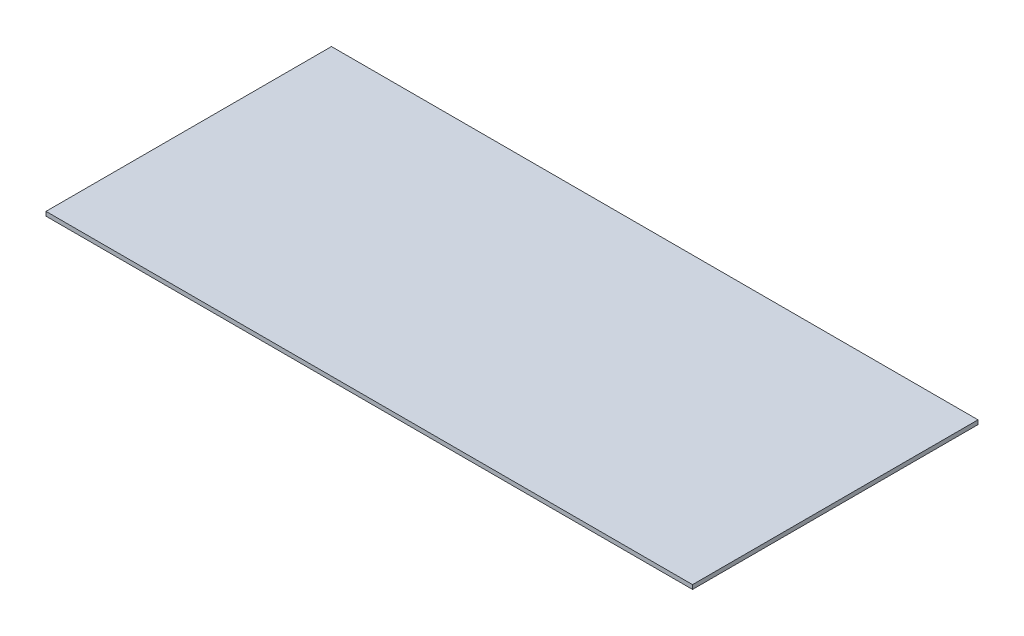
ISO-10303-21;
HEADER;
FILE_DESCRIPTION(('STEP AP214'),'2;1');
FILE_NAME('part.step','',(''),(''),'','','');
FILE_SCHEMA(('AUTOMOTIVE_DESIGN { 1 0 10303 214 1 1 1 1 }'));
ENDSEC;
DATA;
#1=APPLICATION_CONTEXT('core data for automotive mechanical design processes');
#2=APPLICATION_PROTOCOL_DEFINITION('international standard','automotive_design',2000,#1);
#3=PRODUCT_CONTEXT('',#1,'mechanical');
#4=PRODUCT('Part','Part','',(#3));
#5=PRODUCT_RELATED_PRODUCT_CATEGORY('part','',(#4));
#6=PRODUCT_DEFINITION_FORMATION('','',#4);
#7=PRODUCT_DEFINITION_CONTEXT('part definition',#1,'design');
#8=PRODUCT_DEFINITION('design','',#6,#7);
#9=PRODUCT_DEFINITION_SHAPE('','',#8);
#10=(LENGTH_UNIT() NAMED_UNIT(*) SI_UNIT(.MILLI.,.METRE.));
#11=(NAMED_UNIT(*) PLANE_ANGLE_UNIT() SI_UNIT($,.RADIAN.));
#12=(NAMED_UNIT(*) SI_UNIT($,.STERADIAN.) SOLID_ANGLE_UNIT());
#13=UNCERTAINTY_MEASURE_WITH_UNIT(LENGTH_MEASURE(1.E-05),#10,'distance_accuracy_value','');
#14=(GEOMETRIC_REPRESENTATION_CONTEXT(3) GLOBAL_UNCERTAINTY_ASSIGNED_CONTEXT((#13)) GLOBAL_UNIT_ASSIGNED_CONTEXT((#10,
#11,#12)) REPRESENTATION_CONTEXT('',''));
#15=CARTESIAN_POINT('',(0.,0.,0.));
#16=DIRECTION('',(0.,0.,1.));
#17=DIRECTION('',(1.,0.,0.));
#18=AXIS2_PLACEMENT_3D('',#15,#16,#17);
#19=CARTESIAN_POINT('',(-488.95,6.35,215.9));
#20=DIRECTION('',(1.,0.,0.));
#21=DIRECTION('',(0.,0.,-1.));
#22=AXIS2_PLACEMENT_3D('',#19,#20,#21);
#23=PLANE('',#22);
#24=DIRECTION('',(0.,0.,1.));
#25=VECTOR('',#24,1.);
#26=CARTESIAN_POINT('',(-488.95,0.,215.9));
#27=LINE('',#26,#25);
#28=CARTESIAN_POINT('',(-488.95,0.,-215.9));
#29=VERTEX_POINT('',#28);
#30=CARTESIAN_POINT('',(-488.95,0.,215.9));
#31=VERTEX_POINT('',#30);
#32=EDGE_CURVE('E96',#29,#31,#27,.T.);
#33=ORIENTED_EDGE('',*,*,#32,.T.);
#34=DIRECTION('',(0.,-1.,0.));
#35=VECTOR('',#34,1.);
#36=CARTESIAN_POINT('',(-488.95,6.35,215.9));
#37=LINE('',#36,#35);
#38=CARTESIAN_POINT('',(-488.95,6.35,215.9));
#39=VERTEX_POINT('',#38);
#40=EDGE_CURVE('E11',#39,#31,#37,.T.);
#41=ORIENTED_EDGE('',*,*,#40,.F.);
#42=DIRECTION('',(0.,0.,1.));
#43=VECTOR('',#42,1.);
#44=CARTESIAN_POINT('',(-488.95,6.35,215.9));
#45=LINE('',#44,#43);
#46=CARTESIAN_POINT('',(-488.95,6.35,-215.9));
#47=VERTEX_POINT('',#46);
#48=EDGE_CURVE('E84',#47,#39,#45,.T.);
#49=ORIENTED_EDGE('',*,*,#48,.F.);
#50=DIRECTION('',(0.,-1.,0.));
#51=VECTOR('',#50,1.);
#52=CARTESIAN_POINT('',(-488.95,6.35,-215.9));
#53=LINE('',#52,#51);
#54=EDGE_CURVE('E92',#47,#29,#53,.T.);
#55=ORIENTED_EDGE('',*,*,#54,.T.);
#56=EDGE_LOOP('',(#33,#41,#49,#55));
#57=FACE_BOUND('',#56,.T.);
#58=ADVANCED_FACE('F33',(#57),#23,.F.);
#59=CARTESIAN_POINT('',(488.95,6.35,215.9));
#60=DIRECTION('',(0.,0.,-1.));
#61=DIRECTION('',(-1.,0.,0.));
#62=AXIS2_PLACEMENT_3D('',#59,#60,#61);
#63=PLANE('',#62);
#64=DIRECTION('',(1.,0.,0.));
#65=VECTOR('',#64,1.);
#66=CARTESIAN_POINT('',(488.95,0.,215.9));
#67=LINE('',#66,#65);
#68=CARTESIAN_POINT('',(488.95,0.,215.9));
#69=VERTEX_POINT('',#68);
#70=EDGE_CURVE('E88',#31,#69,#67,.T.);
#71=ORIENTED_EDGE('',*,*,#70,.T.);
#72=DIRECTION('',(0.,-1.,0.));
#73=VECTOR('',#72,1.);
#74=CARTESIAN_POINT('',(488.95,6.35,215.9));
#75=LINE('',#74,#73);
#76=CARTESIAN_POINT('',(488.95,6.35,215.9));
#77=VERTEX_POINT('',#76);
#78=EDGE_CURVE('E41',#77,#69,#75,.T.);
#79=ORIENTED_EDGE('',*,*,#78,.F.);
#80=DIRECTION('',(1.,0.,0.));
#81=VECTOR('',#80,1.);
#82=CARTESIAN_POINT('',(488.95,6.35,215.9));
#83=LINE('',#82,#81);
#84=EDGE_CURVE('E79',#39,#77,#83,.T.);
#85=ORIENTED_EDGE('',*,*,#84,.F.);
#86=ORIENTED_EDGE('',*,*,#40,.T.);
#87=EDGE_LOOP('',(#71,#79,#85,#86));
#88=FACE_BOUND('',#87,.T.);
#89=ADVANCED_FACE('F87',(#88),#63,.F.);
#90=CARTESIAN_POINT('',(488.95,6.35,215.9));
#91=DIRECTION('',(-1.,0.,0.));
#92=DIRECTION('',(0.,0.,1.));
#93=AXIS2_PLACEMENT_3D('',#90,#91,#92);
#94=PLANE('',#93);
#95=DIRECTION('',(0.,0.,-1.));
#96=VECTOR('',#95,1.);
#97=CARTESIAN_POINT('',(488.95,0.,215.9));
#98=LINE('',#97,#96);
#99=CARTESIAN_POINT('',(488.95,0.,-215.9));
#100=VERTEX_POINT('',#99);
#101=EDGE_CURVE('E66',#69,#100,#98,.T.);
#102=ORIENTED_EDGE('',*,*,#101,.T.);
#103=DIRECTION('',(0.,-1.,0.));
#104=VECTOR('',#103,1.);
#105=CARTESIAN_POINT('',(488.95,6.35,-215.9));
#106=LINE('',#105,#104);
#107=CARTESIAN_POINT('',(488.95,6.35,-215.9));
#108=VERTEX_POINT('',#107);
#109=EDGE_CURVE('E89',#108,#100,#106,.T.);
#110=ORIENTED_EDGE('',*,*,#109,.F.);
#111=DIRECTION('',(0.,0.,-1.));
#112=VECTOR('',#111,1.);
#113=CARTESIAN_POINT('',(488.95,6.35,215.9));
#114=LINE('',#113,#112);
#115=EDGE_CURVE('E82',#77,#108,#114,.T.);
#116=ORIENTED_EDGE('',*,*,#115,.F.);
#117=ORIENTED_EDGE('',*,*,#78,.T.);
#118=EDGE_LOOP('',(#102,#110,#116,#117));
#119=FACE_BOUND('',#118,.T.);
#120=ADVANCED_FACE('F90',(#119),#94,.F.);
#121=CARTESIAN_POINT('',(488.95,6.35,-215.9));
#122=DIRECTION('',(0.,0.,1.));
#123=DIRECTION('',(1.,0.,0.));
#124=AXIS2_PLACEMENT_3D('',#121,#122,#123);
#125=PLANE('',#124);
#126=DIRECTION('',(-1.,0.,0.));
#127=VECTOR('',#126,1.);
#128=CARTESIAN_POINT('',(488.95,0.,-215.9));
#129=LINE('',#128,#127);
#130=EDGE_CURVE('E72',#100,#29,#129,.T.);
#131=ORIENTED_EDGE('',*,*,#130,.T.);
#132=ORIENTED_EDGE('',*,*,#54,.F.);
#133=DIRECTION('',(-1.,0.,0.));
#134=VECTOR('',#133,1.);
#135=CARTESIAN_POINT('',(488.95,6.35,-215.9));
#136=LINE('',#135,#134);
#137=EDGE_CURVE('E49',#108,#47,#136,.T.);
#138=ORIENTED_EDGE('',*,*,#137,.F.);
#139=ORIENTED_EDGE('',*,*,#109,.T.);
#140=EDGE_LOOP('',(#131,#132,#138,#139));
#141=FACE_BOUND('',#140,.T.);
#142=ADVANCED_FACE('F103',(#141),#125,.F.);
#143=CARTESIAN_POINT('',(0.,6.35,0.));
#144=DIRECTION('',(0.,1.,0.));
#145=DIRECTION('',(0.,0.,1.));
#146=AXIS2_PLACEMENT_3D('',#143,#144,#145);
#147=PLANE('',#146);
#148=ORIENTED_EDGE('',*,*,#48,.T.);
#149=ORIENTED_EDGE('',*,*,#84,.T.);
#150=ORIENTED_EDGE('',*,*,#115,.T.);
#151=ORIENTED_EDGE('',*,*,#137,.T.);
#152=EDGE_LOOP('',(#148,#149,#150,#151));
#153=FACE_BOUND('',#152,.T.);
#154=ADVANCED_FACE('F80',(#153),#147,.T.);
#155=CARTESIAN_POINT('',(0.,0.,0.));
#156=DIRECTION('',(0.,1.,0.));
#157=DIRECTION('',(0.,0.,1.));
#158=AXIS2_PLACEMENT_3D('',#155,#156,#157);
#159=PLANE('',#158);
#160=ORIENTED_EDGE('',*,*,#32,.F.);
#161=ORIENTED_EDGE('',*,*,#130,.F.);
#162=ORIENTED_EDGE('',*,*,#101,.F.);
#163=ORIENTED_EDGE('',*,*,#70,.F.);
#164=EDGE_LOOP('',(#160,#161,#162,#163));
#165=FACE_BOUND('',#164,.T.);
#166=ADVANCED_FACE('F106',(#165),#159,.F.);
#167=CLOSED_SHELL('',(#58,#89,#120,#142,#154,#166));
#168=MANIFOLD_SOLID_BREP('B2',#167);
#169=ADVANCED_BREP_SHAPE_REPRESENTATION('',(#18,#168),#14);
#170=SHAPE_DEFINITION_REPRESENTATION(#9,#169);
ENDSEC;
END-ISO-10303-21;
